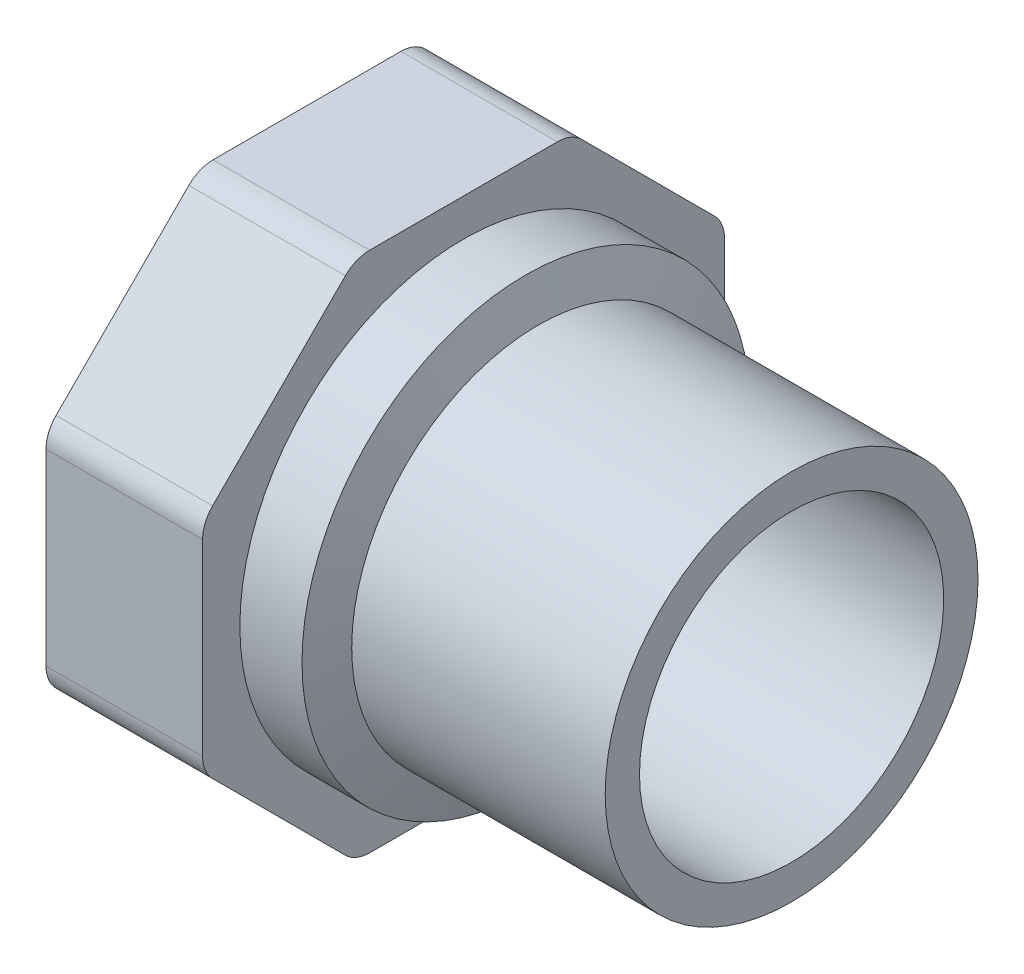
ISO-10303-21;
HEADER;
FILE_DESCRIPTION(('STEP AP214'),'2;1');
FILE_NAME('part.step','',(''),(''),'','','');
FILE_SCHEMA(('AUTOMOTIVE_DESIGN { 1 0 10303 214 1 1 1 1 }'));
ENDSEC;
DATA;
#1=APPLICATION_CONTEXT('core data for automotive mechanical design processes');
#2=APPLICATION_PROTOCOL_DEFINITION('international standard','automotive_design',2000,#1);
#3=PRODUCT_CONTEXT('',#1,'mechanical');
#4=PRODUCT('Part','Part','',(#3));
#5=PRODUCT_RELATED_PRODUCT_CATEGORY('part','',(#4));
#6=PRODUCT_DEFINITION_FORMATION('','',#4);
#7=PRODUCT_DEFINITION_CONTEXT('part definition',#1,'design');
#8=PRODUCT_DEFINITION('design','',#6,#7);
#9=PRODUCT_DEFINITION_SHAPE('','',#8);
#10=(LENGTH_UNIT() NAMED_UNIT(*) SI_UNIT(.MILLI.,.METRE.));
#11=(NAMED_UNIT(*) PLANE_ANGLE_UNIT() SI_UNIT($,.RADIAN.));
#12=(NAMED_UNIT(*) SI_UNIT($,.STERADIAN.) SOLID_ANGLE_UNIT());
#13=UNCERTAINTY_MEASURE_WITH_UNIT(LENGTH_MEASURE(1.E-05),#10,'distance_accuracy_value','');
#14=(GEOMETRIC_REPRESENTATION_CONTEXT(3) GLOBAL_UNCERTAINTY_ASSIGNED_CONTEXT((#13)) GLOBAL_UNIT_ASSIGNED_CONTEXT((#10,
#11,#12)) REPRESENTATION_CONTEXT('',''));
#15=CARTESIAN_POINT('',(0.,0.,0.));
#16=DIRECTION('',(0.,0.,1.));
#17=DIRECTION('',(1.,0.,0.));
#18=AXIS2_PLACEMENT_3D('',#15,#16,#17);
#19=CARTESIAN_POINT('',(-34.,0.,0.));
#20=DIRECTION('',(-1.,0.,0.));
#21=DIRECTION('',(0.,0.,1.));
#22=AXIS2_PLACEMENT_3D('',#19,#20,#21);
#23=CYLINDRICAL_SURFACE('',#22,25.);
#24=CARTESIAN_POINT('',(-34.,0.,0.));
#25=DIRECTION('',(1.,0.,0.));
#26=DIRECTION('',(0.,1.,0.));
#27=AXIS2_PLACEMENT_3D('',#24,#25,#26);
#28=CIRCLE('',#27,25.);
#29=CARTESIAN_POINT('',(-34.,25.,0.));
#30=VERTEX_POINT('',#29);
#31=EDGE_CURVE('E193',#30,#30,#28,.F.);
#32=ORIENTED_EDGE('',*,*,#31,.F.);
#33=EDGE_LOOP('',(#32));
#34=FACE_BOUND('',#33,.T.);
#35=CARTESIAN_POINT('',(0.,0.,0.));
#36=DIRECTION('',(-1.,0.,0.));
#37=DIRECTION('',(0.,0.,1.));
#38=AXIS2_PLACEMENT_3D('',#35,#36,#37);
#39=CIRCLE('',#38,25.);
#40=CARTESIAN_POINT('',(0.,0.,25.));
#41=VERTEX_POINT('',#40);
#42=EDGE_CURVE('E18',#41,#41,#39,.F.);
#43=ORIENTED_EDGE('',*,*,#42,.F.);
#44=EDGE_LOOP('',(#43));
#45=FACE_BOUND('',#44,.T.);
#46=ADVANCED_FACE('F15',(#34,#45),#23,.T.);
#47=CARTESIAN_POINT('',(-34.,0.,0.));
#48=DIRECTION('',(-1.,0.,0.));
#49=DIRECTION('',(0.,0.,1.));
#50=AXIS2_PLACEMENT_3D('',#47,#48,#49);
#51=CONICAL_SURFACE('',#50,25.,1.24904577239826);
#52=CARTESIAN_POINT('',(-35.6666666666666,0.,0.));
#53=DIRECTION('',(-1.,0.,0.));
#54=DIRECTION('',(0.,1.,0.));
#55=AXIS2_PLACEMENT_3D('',#52,#53,#54);
#56=CIRCLE('',#55,30.);
#57=CARTESIAN_POINT('',(-35.6666666666666,30.,0.));
#58=VERTEX_POINT('',#57);
#59=EDGE_CURVE('E189',#58,#58,#56,.T.);
#60=ORIENTED_EDGE('',*,*,#59,.F.);
#61=EDGE_LOOP('',(#60));
#62=FACE_BOUND('',#61,.T.);
#63=ORIENTED_EDGE('',*,*,#31,.T.);
#64=EDGE_LOOP('',(#63));
#65=FACE_BOUND('',#64,.T.);
#66=ADVANCED_FACE('F268',(#62,#65),#51,.T.);
#67=CARTESIAN_POINT('',(0.,25.,25.3000021083545));
#68=DIRECTION('',(1.,0.,0.));
#69=DIRECTION('',(0.,-1.,0.));
#70=AXIS2_PLACEMENT_3D('',#67,#68,#69);
#71=PLANE('',#70);
#72=CARTESIAN_POINT('',(0.,0.,0.));
#73=DIRECTION('',(-1.,0.,0.));
#74=DIRECTION('',(0.,0.,1.));
#75=AXIS2_PLACEMENT_3D('',#72,#73,#74);
#76=CIRCLE('',#75,20.4);
#77=CARTESIAN_POINT('',(0.,0.,20.4));
#78=VERTEX_POINT('',#77);
#79=EDGE_CURVE('E192',#78,#78,#76,.F.);
#80=ORIENTED_EDGE('',*,*,#79,.F.);
#81=EDGE_LOOP('',(#80));
#82=FACE_BOUND('',#81,.T.);
#83=ORIENTED_EDGE('',*,*,#42,.T.);
#84=EDGE_LOOP('',(#83));
#85=FACE_BOUND('',#84,.T.);
#86=ADVANCED_FACE('F264',(#82,#85),#71,.T.);
#87=CARTESIAN_POINT('',(-44.,0.,0.));
#88=DIRECTION('',(-1.,0.,0.));
#89=DIRECTION('',(0.,0.,1.));
#90=AXIS2_PLACEMENT_3D('',#87,#88,#89);
#91=CYLINDRICAL_SURFACE('',#90,30.);
#92=CARTESIAN_POINT('',(-44.,0.,0.));
#93=DIRECTION('',(-1.,0.,0.));
#94=DIRECTION('',(0.,0.,1.));
#95=AXIS2_PLACEMENT_3D('',#92,#93,#94);
#96=CIRCLE('',#95,30.);
#97=CARTESIAN_POINT('',(-44.,0.,30.));
#98=VERTEX_POINT('',#97);
#99=EDGE_CURVE('E188',#98,#98,#96,.T.);
#100=ORIENTED_EDGE('',*,*,#99,.F.);
#101=EDGE_LOOP('',(#100));
#102=FACE_BOUND('',#101,.T.);
#103=ORIENTED_EDGE('',*,*,#59,.T.);
#104=EDGE_LOOP('',(#103));
#105=FACE_BOUND('',#104,.T.);
#106=ADVANCED_FACE('F267',(#102,#105),#91,.T.);
#107=CARTESIAN_POINT('',(0.,0.,0.));
#108=DIRECTION('',(-1.,0.,0.));
#109=DIRECTION('',(0.,0.,1.));
#110=AXIS2_PLACEMENT_3D('',#107,#108,#109);
#111=CYLINDRICAL_SURFACE('',#110,20.4);
#112=ORIENTED_EDGE('',*,*,#79,.T.);
#113=EDGE_LOOP('',(#112));
#114=FACE_BOUND('',#113,.T.);
#115=CARTESIAN_POINT('',(-43.4969631777738,0.,0.));
#116=DIRECTION('',(1.,0.,0.));
#117=DIRECTION('',(0.,1.,0.));
#118=AXIS2_PLACEMENT_3D('',#115,#116,#117);
#119=CIRCLE('',#118,20.4);
#120=CARTESIAN_POINT('',(-43.4969631777738,20.4,0.));
#121=VERTEX_POINT('',#120);
#122=EDGE_CURVE('E135',#121,#121,#119,.T.);
#123=ORIENTED_EDGE('',*,*,#122,.F.);
#124=EDGE_LOOP('',(#123));
#125=FACE_BOUND('',#124,.T.);
#126=ADVANCED_FACE('F261',(#114,#125),#111,.F.);
#127=CARTESIAN_POINT('',(-44.,35.,35.));
#128=DIRECTION('',(1.,0.,0.));
#129=DIRECTION('',(0.,-1.,0.));
#130=AXIS2_PLACEMENT_3D('',#127,#128,#129);
#131=PLANE('',#130);
#132=ORIENTED_EDGE('',*,*,#99,.T.);
#133=EDGE_LOOP('',(#132));
#134=FACE_BOUND('',#133,.T.);
#135=CARTESIAN_POINT('',(-44.,12.5920922961421,30.4));
#136=DIRECTION('',(1.,0.,0.));
#137=DIRECTION('',(0.,0.,-1.));
#138=AXIS2_PLACEMENT_3D('',#135,#136,#137);
#139=CIRCLE('',#138,4.6);
#140=CARTESIAN_POINT('',(-44.,12.5920922961421,35.));
#141=VERTEX_POINT('',#140);
#142=CARTESIAN_POINT('',(-44.,15.8447834896002,33.6526911934581));
#143=VERTEX_POINT('',#142);
#144=EDGE_CURVE('E254',#141,#143,#139,.F.);
#145=ORIENTED_EDGE('',*,*,#144,.F.);
#146=DIRECTION('',(0.,1.,0.));
#147=VECTOR('',#146,1.);
#148=CARTESIAN_POINT('',(-44.,0.,35.));
#149=LINE('',#148,#147);
#150=CARTESIAN_POINT('',(-44.,-12.5920922961421,35.));
#151=VERTEX_POINT('',#150);
#152=EDGE_CURVE('E132',#151,#141,#149,.T.);
#153=ORIENTED_EDGE('',*,*,#152,.F.);
#154=CARTESIAN_POINT('',(-44.,-12.5920922961421,30.4));
#155=DIRECTION('',(1.,0.,0.));
#156=DIRECTION('',(0.,0.,-1.));
#157=AXIS2_PLACEMENT_3D('',#154,#155,#156);
#158=CIRCLE('',#157,4.59999999999999);
#159=CARTESIAN_POINT('',(-44.,-15.8447834896002,33.6526911934581));
#160=VERTEX_POINT('',#159);
#161=EDGE_CURVE('E126',#160,#151,#158,.F.);
#162=ORIENTED_EDGE('',*,*,#161,.F.);
#163=DIRECTION('',(0.,0.707106781186547,0.707106781186548));
#164=VECTOR('',#163,1.);
#165=CARTESIAN_POINT('',(-44.,-24.7487373415292,24.7487373415291));
#166=LINE('',#165,#164);
#167=CARTESIAN_POINT('',(-44.,-33.6526911934581,15.8447834896002));
#168=VERTEX_POINT('',#167);
#169=EDGE_CURVE('E130',#168,#160,#166,.T.);
#170=ORIENTED_EDGE('',*,*,#169,.F.);
#171=CARTESIAN_POINT('',(-44.,-30.3999999999999,12.5920922961421));
#172=DIRECTION('',(1.,0.,0.));
#173=DIRECTION('',(0.,0.,-1.));
#174=AXIS2_PLACEMENT_3D('',#171,#172,#173);
#175=CIRCLE('',#174,4.60000000000004);
#176=CARTESIAN_POINT('',(-44.,-35.,12.5920922961421));
#177=VERTEX_POINT('',#176);
#178=EDGE_CURVE('E149',#177,#168,#175,.F.);
#179=ORIENTED_EDGE('',*,*,#178,.F.);
#180=DIRECTION('',(0.,0.,1.));
#181=VECTOR('',#180,1.);
#182=CARTESIAN_POINT('',(-44.,-35.,0.));
#183=LINE('',#182,#181);
#184=CARTESIAN_POINT('',(-44.,-35.,-12.5920922961421));
#185=VERTEX_POINT('',#184);
#186=EDGE_CURVE('E154',#185,#177,#183,.T.);
#187=ORIENTED_EDGE('',*,*,#186,.F.);
#188=CARTESIAN_POINT('',(-44.,-30.4,-12.5920922961421));
#189=DIRECTION('',(1.,0.,0.));
#190=DIRECTION('',(0.,0.,-1.));
#191=AXIS2_PLACEMENT_3D('',#188,#189,#190);
#192=CIRCLE('',#191,4.60000000000004);
#193=CARTESIAN_POINT('',(-44.,-33.6526911934581,-15.8447834896002));
#194=VERTEX_POINT('',#193);
#195=EDGE_CURVE('E239',#194,#185,#192,.F.);
#196=ORIENTED_EDGE('',*,*,#195,.F.);
#197=DIRECTION('',(0.,-0.707106781186548,0.707106781186547));
#198=VECTOR('',#197,1.);
#199=CARTESIAN_POINT('',(-44.,-24.7487373415292,-24.7487373415292));
#200=LINE('',#199,#198);
#201=CARTESIAN_POINT('',(-44.,-15.8447834896002,-33.6526911934581));
#202=VERTEX_POINT('',#201);
#203=EDGE_CURVE('E159',#202,#194,#200,.T.);
#204=ORIENTED_EDGE('',*,*,#203,.F.);
#205=CARTESIAN_POINT('',(-44.,-12.5920922961421,-30.4));
#206=DIRECTION('',(1.,0.,0.));
#207=DIRECTION('',(0.,0.,-1.));
#208=AXIS2_PLACEMENT_3D('',#205,#206,#207);
#209=CIRCLE('',#208,4.59999999999998);
#210=CARTESIAN_POINT('',(-44.,-12.5920922961421,-35.));
#211=VERTEX_POINT('',#210);
#212=EDGE_CURVE('E242',#211,#202,#209,.F.);
#213=ORIENTED_EDGE('',*,*,#212,.F.);
#214=DIRECTION('',(0.,-1.,0.));
#215=VECTOR('',#214,1.);
#216=CARTESIAN_POINT('',(-44.,0.,-35.));
#217=LINE('',#216,#215);
#218=CARTESIAN_POINT('',(-44.,12.5920922961421,-35.));
#219=VERTEX_POINT('',#218);
#220=EDGE_CURVE('E164',#219,#211,#217,.T.);
#221=ORIENTED_EDGE('',*,*,#220,.F.);
#222=CARTESIAN_POINT('',(-44.,12.5920922961421,-30.4));
#223=DIRECTION('',(1.,0.,0.));
#224=DIRECTION('',(0.,0.,-1.));
#225=AXIS2_PLACEMENT_3D('',#222,#223,#224);
#226=CIRCLE('',#225,4.59999999999999);
#227=CARTESIAN_POINT('',(-44.,15.8447834896002,-33.6526911934581));
#228=VERTEX_POINT('',#227);
#229=EDGE_CURVE('E245',#228,#219,#226,.F.);
#230=ORIENTED_EDGE('',*,*,#229,.F.);
#231=DIRECTION('',(0.,-0.707106781186548,-0.707106781186548));
#232=VECTOR('',#231,1.);
#233=CARTESIAN_POINT('',(-44.,24.7487373415292,-24.7487373415292));
#234=LINE('',#233,#232);
#235=CARTESIAN_POINT('',(-44.,33.6526911934581,-15.8447834896002));
#236=VERTEX_POINT('',#235);
#237=EDGE_CURVE('E169',#236,#228,#234,.T.);
#238=ORIENTED_EDGE('',*,*,#237,.F.);
#239=CARTESIAN_POINT('',(-44.,30.4,-12.5920922961421));
#240=DIRECTION('',(1.,0.,0.));
#241=DIRECTION('',(0.,0.,-1.));
#242=AXIS2_PLACEMENT_3D('',#239,#240,#241);
#243=CIRCLE('',#242,4.60000000000003);
#244=CARTESIAN_POINT('',(-44.,35.,-12.5920922961421));
#245=VERTEX_POINT('',#244);
#246=EDGE_CURVE('E248',#245,#236,#243,.F.);
#247=ORIENTED_EDGE('',*,*,#246,.F.);
#248=DIRECTION('',(0.,0.,-1.));
#249=VECTOR('',#248,1.);
#250=CARTESIAN_POINT('',(-44.,35.,0.));
#251=LINE('',#250,#249);
#252=CARTESIAN_POINT('',(-44.,35.,12.5920922961421));
#253=VERTEX_POINT('',#252);
#254=EDGE_CURVE('E174',#253,#245,#251,.T.);
#255=ORIENTED_EDGE('',*,*,#254,.F.);
#256=CARTESIAN_POINT('',(-44.,30.4,12.5920922961421));
#257=DIRECTION('',(1.,0.,0.));
#258=DIRECTION('',(0.,0.,-1.));
#259=AXIS2_PLACEMENT_3D('',#256,#257,#258);
#260=CIRCLE('',#259,4.60000000000003);
#261=CARTESIAN_POINT('',(-44.,33.6526911934581,15.8447834896002));
#262=VERTEX_POINT('',#261);
#263=EDGE_CURVE('E251',#262,#253,#260,.F.);
#264=ORIENTED_EDGE('',*,*,#263,.F.);
#265=DIRECTION('',(0.,0.707106781186547,-0.707106781186547));
#266=VECTOR('',#265,1.);
#267=CARTESIAN_POINT('',(-44.,24.7487373415292,24.7487373415292));
#268=LINE('',#267,#266);
#269=EDGE_CURVE('E179',#143,#262,#268,.T.);
#270=ORIENTED_EDGE('',*,*,#269,.F.);
#271=EDGE_LOOP('',(#145,#153,#162,#170,#179,#187,#196,#204,#213,#221,#230,#238,#247,#255,#264,#270));
#272=FACE_BOUND('',#271,.T.);
#273=ADVANCED_FACE('F128',(#134,#272),#131,.T.);
#274=CARTESIAN_POINT('',(-44.,0.,0.));
#275=DIRECTION('',(-1.,0.,0.));
#276=DIRECTION('',(0.,0.,1.));
#277=AXIS2_PLACEMENT_3D('',#274,#275,#276);
#278=CONICAL_SURFACE('',#277,21.2712853341737,1.0471975511966);
#279=ORIENTED_EDGE('',*,*,#122,.T.);
#280=EDGE_LOOP('',(#279));
#281=FACE_BOUND('',#280,.T.);
#282=CARTESIAN_POINT('',(-44.,0.,0.));
#283=DIRECTION('',(1.,0.,0.));
#284=DIRECTION('',(0.,1.,0.));
#285=AXIS2_PLACEMENT_3D('',#282,#283,#284);
#286=CIRCLE('',#285,21.2712853341737);
#287=CARTESIAN_POINT('',(-44.,21.2712853341737,0.));
#288=VERTEX_POINT('',#287);
#289=EDGE_CURVE('E153',#288,#288,#286,.T.);
#290=ORIENTED_EDGE('',*,*,#289,.F.);
#291=EDGE_LOOP('',(#290));
#292=FACE_BOUND('',#291,.T.);
#293=ADVANCED_FACE('F438',(#281,#292),#278,.F.);
#294=CARTESIAN_POINT('',(-44.,-12.5920922961421,30.4));
#295=DIRECTION('',(1.,0.,0.));
#296=DIRECTION('',(0.,0.,-1.));
#297=AXIS2_PLACEMENT_3D('',#294,#295,#296);
#298=CYLINDRICAL_SURFACE('',#297,4.59999999999999);
#299=CARTESIAN_POINT('',(-65.,-12.5920922961421,30.4));
#300=DIRECTION('',(1.,0.,0.));
#301=DIRECTION('',(0.,0.,-1.));
#302=AXIS2_PLACEMENT_3D('',#299,#300,#301);
#303=CIRCLE('',#302,4.59999999999999);
#304=CARTESIAN_POINT('',(-65.,-15.8447834896002,33.6526911934581));
#305=VERTEX_POINT('',#304);
#306=CARTESIAN_POINT('',(-65.,-12.5920922961421,35.));
#307=VERTEX_POINT('',#306);
#308=EDGE_CURVE('E141',#305,#307,#303,.F.);
#309=ORIENTED_EDGE('',*,*,#308,.F.);
#310=DIRECTION('',(1.,0.,0.));
#311=VECTOR('',#310,1.);
#312=CARTESIAN_POINT('',(-65.,-15.8447834896002,33.6526911934581));
#313=LINE('',#312,#311);
#314=EDGE_CURVE('E138',#160,#305,#313,.F.);
#315=ORIENTED_EDGE('',*,*,#314,.F.);
#316=ORIENTED_EDGE('',*,*,#161,.T.);
#317=DIRECTION('',(1.,0.,0.));
#318=VECTOR('',#317,1.);
#319=CARTESIAN_POINT('',(-65.,-12.5920922961421,35.));
#320=LINE('',#319,#318);
#321=EDGE_CURVE('E185',#307,#151,#320,.T.);
#322=ORIENTED_EDGE('',*,*,#321,.F.);
#323=EDGE_LOOP('',(#309,#315,#316,#322));
#324=FACE_BOUND('',#323,.T.);
#325=ADVANCED_FACE('F139',(#324),#298,.T.);
#326=CARTESIAN_POINT('',(-65.,12.5920922961421,35.));
#327=DIRECTION('',(0.,0.,1.));
#328=DIRECTION('',(0.,-1.,0.));
#329=AXIS2_PLACEMENT_3D('',#326,#327,#328);
#330=PLANE('',#329);
#331=DIRECTION('',(0.,1.,0.));
#332=VECTOR('',#331,1.);
#333=CARTESIAN_POINT('',(-65.,0.,35.));
#334=LINE('',#333,#332);
#335=CARTESIAN_POINT('',(-65.,12.5920922961421,35.));
#336=VERTEX_POINT('',#335);
#337=EDGE_CURVE('E236',#307,#336,#334,.T.);
#338=ORIENTED_EDGE('',*,*,#337,.F.);
#339=ORIENTED_EDGE('',*,*,#321,.T.);
#340=ORIENTED_EDGE('',*,*,#152,.T.);
#341=DIRECTION('',(1.,0.,0.));
#342=VECTOR('',#341,1.);
#343=CARTESIAN_POINT('',(-54.5,12.5920922961421,35.));
#344=LINE('',#343,#342);
#345=EDGE_CURVE('E183',#336,#141,#344,.T.);
#346=ORIENTED_EDGE('',*,*,#345,.F.);
#347=EDGE_LOOP('',(#338,#339,#340,#346));
#348=FACE_BOUND('',#347,.T.);
#349=ADVANCED_FACE('F387',(#348),#330,.T.);
#350=CARTESIAN_POINT('',(-44.,12.5920922961421,30.4));
#351=DIRECTION('',(1.,0.,0.));
#352=DIRECTION('',(0.,0.,-1.));
#353=AXIS2_PLACEMENT_3D('',#350,#351,#352);
#354=CYLINDRICAL_SURFACE('',#353,4.6);
#355=CARTESIAN_POINT('',(-65.,12.5920922961421,30.4));
#356=DIRECTION('',(1.,0.,0.));
#357=DIRECTION('',(0.,0.,-1.));
#358=AXIS2_PLACEMENT_3D('',#355,#356,#357);
#359=CIRCLE('',#358,4.6);
#360=CARTESIAN_POINT('',(-65.,15.8447834896002,33.6526911934581));
#361=VERTEX_POINT('',#360);
#362=EDGE_CURVE('E233',#336,#361,#359,.F.);
#363=ORIENTED_EDGE('',*,*,#362,.F.);
#364=ORIENTED_EDGE('',*,*,#345,.T.);
#365=ORIENTED_EDGE('',*,*,#144,.T.);
#366=DIRECTION('',(1.,0.,0.));
#367=VECTOR('',#366,1.);
#368=CARTESIAN_POINT('',(-65.,15.8447834896002,33.6526911934581));
#369=LINE('',#368,#367);
#370=EDGE_CURVE('E182',#361,#143,#369,.T.);
#371=ORIENTED_EDGE('',*,*,#370,.F.);
#372=EDGE_LOOP('',(#363,#364,#365,#371));
#373=FACE_BOUND('',#372,.T.);
#374=ADVANCED_FACE('F425',(#373),#354,.T.);
#375=CARTESIAN_POINT('',(-65.,33.6526911934581,15.8447834896002));
#376=DIRECTION('',(0.,0.707106781186547,0.707106781186547));
#377=DIRECTION('',(0.,-0.707106781186547,0.707106781186547));
#378=AXIS2_PLACEMENT_3D('',#375,#376,#377);
#379=PLANE('',#378);
#380=CARTESIAN_POINT('',(-65.,15.8447834896002,33.6526911934581));
#381=CARTESIAN_POINT('',(-65.,16.5867796439276,32.9106950391307));
#382=CARTESIAN_POINT('',(-65.,17.328775798255,32.1686988848033));
#383=CARTESIAN_POINT('',(-65.,18.8127681069099,30.6847065761485));
#384=CARTESIAN_POINT('',(-65.,19.5547642612373,29.9427104218211));
#385=CARTESIAN_POINT('',(-65.,21.0387565698921,28.4587181131662));
#386=CARTESIAN_POINT('',(-65.,21.7807527242195,27.7167219588388));
#387=CARTESIAN_POINT('',(-65.,23.2647450328743,26.232729650184));
#388=CARTESIAN_POINT('',(-65.,24.0067411872017,25.4907334958566));
#389=CARTESIAN_POINT('',(-65.,25.4907334958566,24.0067411872018));
#390=CARTESIAN_POINT('',(-65.,26.232729650184,23.2647450328743));
#391=CARTESIAN_POINT('',(-65.,27.7167219588388,21.7807527242195));
#392=CARTESIAN_POINT('',(-65.,28.4587181131662,21.0387565698921));
#393=CARTESIAN_POINT('',(-65.,29.942710421821,19.5547642612373));
#394=CARTESIAN_POINT('',(-65.,30.6847065761485,18.8127681069099));
#395=CARTESIAN_POINT('',(-65.,32.1686988848033,17.328775798255));
#396=CARTESIAN_POINT('',(-65.,32.9106950391307,16.5867796439276));
#397=CARTESIAN_POINT('',(-65.,33.6526911934581,15.8447834896002));
#398=B_SPLINE_CURVE_WITH_KNOTS('',3,(#380,#381,#382,#383,#384,#385,#386,#387,#388,#389,#390,
#391,#392,#393,#394,#395,#396,#397),.UNSPECIFIED.,.F.,.F.,(4,2,2,2,2,2,2,2,4),(0.,
3.14802307403552,6.29604614807105,9.44406922210656,12.5920922961421,15.7401153701776,
18.8881384442131,22.0361615182486,25.1841845922842),.UNSPECIFIED.);
#399=CARTESIAN_POINT('',(-65.,33.6526911934581,15.8447834896002));
#400=VERTEX_POINT('',#399);
#401=EDGE_CURVE('E232',#361,#400,#398,.T.);
#402=ORIENTED_EDGE('',*,*,#401,.F.);
#403=ORIENTED_EDGE('',*,*,#370,.T.);
#404=ORIENTED_EDGE('',*,*,#269,.T.);
#405=DIRECTION('',(1.,0.,0.));
#406=VECTOR('',#405,1.);
#407=CARTESIAN_POINT('',(-54.5,33.6526911934581,15.8447834896002));
#408=LINE('',#407,#406);
#409=EDGE_CURVE('E178',#400,#262,#408,.T.);
#410=ORIENTED_EDGE('',*,*,#409,.F.);
#411=EDGE_LOOP('',(#402,#403,#404,#410));
#412=FACE_BOUND('',#411,.T.);
#413=ADVANCED_FACE('F423',(#412),#379,.T.);
#414=CARTESIAN_POINT('',(-44.,30.4,12.5920922961421));
#415=DIRECTION('',(1.,0.,0.));
#416=DIRECTION('',(0.,0.,-1.));
#417=AXIS2_PLACEMENT_3D('',#414,#415,#416);
#418=CYLINDRICAL_SURFACE('',#417,4.60000000000003);
#419=CARTESIAN_POINT('',(-65.,30.4,12.5920922961421));
#420=DIRECTION('',(1.,0.,0.));
#421=DIRECTION('',(0.,0.,-1.));
#422=AXIS2_PLACEMENT_3D('',#419,#420,#421);
#423=CIRCLE('',#422,4.60000000000003);
#424=CARTESIAN_POINT('',(-65.,35.,12.5920922961421));
#425=VERTEX_POINT('',#424);
#426=EDGE_CURVE('E229',#400,#425,#423,.F.);
#427=ORIENTED_EDGE('',*,*,#426,.F.);
#428=ORIENTED_EDGE('',*,*,#409,.T.);
#429=ORIENTED_EDGE('',*,*,#263,.T.);
#430=DIRECTION('',(1.,0.,0.));
#431=VECTOR('',#430,1.);
#432=CARTESIAN_POINT('',(-65.,35.,12.5920922961421));
#433=LINE('',#432,#431);
#434=EDGE_CURVE('E177',#425,#253,#433,.T.);
#435=ORIENTED_EDGE('',*,*,#434,.F.);
#436=EDGE_LOOP('',(#427,#428,#429,#435));
#437=FACE_BOUND('',#436,.T.);
#438=ADVANCED_FACE('F420',(#437),#418,.T.);
#439=CARTESIAN_POINT('',(-65.,35.,-12.5920922961421));
#440=DIRECTION('',(0.,1.,0.));
#441=DIRECTION('',(0.,0.,1.));
#442=AXIS2_PLACEMENT_3D('',#439,#440,#441);
#443=PLANE('',#442);
#444=DIRECTION('',(0.,0.,-1.));
#445=VECTOR('',#444,1.);
#446=CARTESIAN_POINT('',(-65.,35.,35.));
#447=LINE('',#446,#445);
#448=CARTESIAN_POINT('',(-65.,35.,-12.5920922961421));
#449=VERTEX_POINT('',#448);
#450=EDGE_CURVE('E228',#425,#449,#447,.T.);
#451=ORIENTED_EDGE('',*,*,#450,.F.);
#452=ORIENTED_EDGE('',*,*,#434,.T.);
#453=ORIENTED_EDGE('',*,*,#254,.T.);
#454=DIRECTION('',(1.,0.,0.));
#455=VECTOR('',#454,1.);
#456=CARTESIAN_POINT('',(-54.5,35.,-12.5920922961421));
#457=LINE('',#456,#455);
#458=EDGE_CURVE('E173',#449,#245,#457,.T.);
#459=ORIENTED_EDGE('',*,*,#458,.F.);
#460=EDGE_LOOP('',(#451,#452,#453,#459));
#461=FACE_BOUND('',#460,.T.);
#462=ADVANCED_FACE('F417',(#461),#443,.T.);
#463=CARTESIAN_POINT('',(-44.,30.4,-12.5920922961421));
#464=DIRECTION('',(1.,0.,0.));
#465=DIRECTION('',(0.,0.,-1.));
#466=AXIS2_PLACEMENT_3D('',#463,#464,#465);
#467=CYLINDRICAL_SURFACE('',#466,4.60000000000003);
#468=CARTESIAN_POINT('',(-65.,30.4,-12.5920922961421));
#469=DIRECTION('',(1.,0.,0.));
#470=DIRECTION('',(0.,0.,-1.));
#471=AXIS2_PLACEMENT_3D('',#468,#469,#470);
#472=CIRCLE('',#471,4.60000000000003);
#473=CARTESIAN_POINT('',(-65.,33.6526911934581,-15.8447834896002));
#474=VERTEX_POINT('',#473);
#475=EDGE_CURVE('E225',#449,#474,#472,.F.);
#476=ORIENTED_EDGE('',*,*,#475,.F.);
#477=ORIENTED_EDGE('',*,*,#458,.T.);
#478=ORIENTED_EDGE('',*,*,#246,.T.);
#479=DIRECTION('',(1.,0.,0.));
#480=VECTOR('',#479,1.);
#481=CARTESIAN_POINT('',(-65.,33.6526911934581,-15.8447834896002));
#482=LINE('',#481,#480);
#483=EDGE_CURVE('E172',#474,#236,#482,.T.);
#484=ORIENTED_EDGE('',*,*,#483,.F.);
#485=EDGE_LOOP('',(#476,#477,#478,#484));
#486=FACE_BOUND('',#485,.T.);
#487=ADVANCED_FACE('F414',(#486),#467,.T.);
#488=CARTESIAN_POINT('',(-65.,15.8447834896002,-33.6526911934581));
#489=DIRECTION('',(0.,0.707106781186547,-0.707106781186547));
#490=DIRECTION('',(0.,0.707106781186547,0.707106781186547));
#491=AXIS2_PLACEMENT_3D('',#488,#489,#490);
#492=PLANE('',#491);
#493=CARTESIAN_POINT('',(-65.,33.6526911934581,-15.8447834896002));
#494=CARTESIAN_POINT('',(-65.,32.9106950391307,-16.5867796439276));
#495=CARTESIAN_POINT('',(-65.,32.1686988848033,-17.328775798255));
#496=CARTESIAN_POINT('',(-65.,30.6847065761485,-18.8127681069099));
#497=CARTESIAN_POINT('',(-65.,29.9427104218211,-19.5547642612373));
#498=CARTESIAN_POINT('',(-65.,28.4587181131662,-21.0387565698921));
#499=CARTESIAN_POINT('',(-65.,27.7167219588388,-21.7807527242195));
#500=CARTESIAN_POINT('',(-65.,26.232729650184,-23.2647450328743));
#501=CARTESIAN_POINT('',(-65.,25.4907334958566,-24.0067411872017));
#502=CARTESIAN_POINT('',(-65.,24.0067411872018,-25.4907334958566));
#503=CARTESIAN_POINT('',(-65.,23.2647450328744,-26.232729650184));
#504=CARTESIAN_POINT('',(-65.,21.7807527242195,-27.7167219588388));
#505=CARTESIAN_POINT('',(-65.,21.0387565698921,-28.4587181131662));
#506=CARTESIAN_POINT('',(-65.,19.5547642612373,-29.942710421821));
#507=CARTESIAN_POINT('',(-65.,18.8127681069099,-30.6847065761485));
#508=CARTESIAN_POINT('',(-65.,17.3287757982551,-32.1686988848033));
#509=CARTESIAN_POINT('',(-65.,16.5867796439276,-32.9106950391307));
#510=CARTESIAN_POINT('',(-65.,15.8447834896002,-33.6526911934581));
#511=B_SPLINE_CURVE_WITH_KNOTS('',3,(#493,#494,#495,#496,#497,#498,#499,#500,#501,#502,#503,
#504,#505,#506,#507,#508,#509,#510),.UNSPECIFIED.,.F.,.F.,(4,2,2,2,2,2,2,2,4),(0.,
3.14802307403552,6.29604614807105,9.44406922210656,12.5920922961421,15.7401153701776,
18.8881384442131,22.0361615182486,25.1841845922842),.UNSPECIFIED.);
#512=CARTESIAN_POINT('',(-65.,15.8447834896002,-33.6526911934581));
#513=VERTEX_POINT('',#512);
#514=EDGE_CURVE('E224',#474,#513,#511,.T.);
#515=ORIENTED_EDGE('',*,*,#514,.F.);
#516=ORIENTED_EDGE('',*,*,#483,.T.);
#517=ORIENTED_EDGE('',*,*,#237,.T.);
#518=DIRECTION('',(1.,0.,0.));
#519=VECTOR('',#518,1.);
#520=CARTESIAN_POINT('',(-54.5,15.8447834896002,-33.6526911934581));
#521=LINE('',#520,#519);
#522=EDGE_CURVE('E168',#513,#228,#521,.T.);
#523=ORIENTED_EDGE('',*,*,#522,.F.);
#524=EDGE_LOOP('',(#515,#516,#517,#523));
#525=FACE_BOUND('',#524,.T.);
#526=ADVANCED_FACE('F411',(#525),#492,.T.);
#527=CARTESIAN_POINT('',(-44.,12.5920922961421,-30.4));
#528=DIRECTION('',(1.,0.,0.));
#529=DIRECTION('',(0.,0.,-1.));
#530=AXIS2_PLACEMENT_3D('',#527,#528,#529);
#531=CYLINDRICAL_SURFACE('',#530,4.59999999999999);
#532=CARTESIAN_POINT('',(-65.,12.5920922961421,-30.4));
#533=DIRECTION('',(1.,0.,0.));
#534=DIRECTION('',(0.,0.,-1.));
#535=AXIS2_PLACEMENT_3D('',#532,#533,#534);
#536=CIRCLE('',#535,4.59999999999999);
#537=CARTESIAN_POINT('',(-65.,12.5920922961421,-35.));
#538=VERTEX_POINT('',#537);
#539=EDGE_CURVE('E221',#513,#538,#536,.F.);
#540=ORIENTED_EDGE('',*,*,#539,.F.);
#541=ORIENTED_EDGE('',*,*,#522,.T.);
#542=ORIENTED_EDGE('',*,*,#229,.T.);
#543=DIRECTION('',(1.,0.,0.));
#544=VECTOR('',#543,1.);
#545=CARTESIAN_POINT('',(-65.,12.5920922961421,-35.));
#546=LINE('',#545,#544);
#547=EDGE_CURVE('E167',#538,#219,#546,.T.);
#548=ORIENTED_EDGE('',*,*,#547,.F.);
#549=EDGE_LOOP('',(#540,#541,#542,#548));
#550=FACE_BOUND('',#549,.T.);
#551=ADVANCED_FACE('F408',(#550),#531,.T.);
#552=CARTESIAN_POINT('',(-65.,-12.5920922961421,-35.));
#553=DIRECTION('',(0.,0.,-1.));
#554=DIRECTION('',(0.,1.,0.));
#555=AXIS2_PLACEMENT_3D('',#552,#553,#554);
#556=PLANE('',#555);
#557=DIRECTION('',(0.,-1.,0.));
#558=VECTOR('',#557,1.);
#559=CARTESIAN_POINT('',(-65.,0.,-35.));
#560=LINE('',#559,#558);
#561=CARTESIAN_POINT('',(-65.,-12.5920922961421,-35.));
#562=VERTEX_POINT('',#561);
#563=EDGE_CURVE('E220',#538,#562,#560,.T.);
#564=ORIENTED_EDGE('',*,*,#563,.F.);
#565=ORIENTED_EDGE('',*,*,#547,.T.);
#566=ORIENTED_EDGE('',*,*,#220,.T.);
#567=DIRECTION('',(1.,0.,0.));
#568=VECTOR('',#567,1.);
#569=CARTESIAN_POINT('',(-54.5,-12.5920922961421,-35.));
#570=LINE('',#569,#568);
#571=EDGE_CURVE('E163',#562,#211,#570,.T.);
#572=ORIENTED_EDGE('',*,*,#571,.F.);
#573=EDGE_LOOP('',(#564,#565,#566,#572));
#574=FACE_BOUND('',#573,.T.);
#575=ADVANCED_FACE('F405',(#574),#556,.T.);
#576=CARTESIAN_POINT('',(-44.,-12.5920922961421,-30.4));
#577=DIRECTION('',(1.,0.,0.));
#578=DIRECTION('',(0.,0.,-1.));
#579=AXIS2_PLACEMENT_3D('',#576,#577,#578);
#580=CYLINDRICAL_SURFACE('',#579,4.59999999999998);
#581=CARTESIAN_POINT('',(-65.,-12.5920922961421,-30.4));
#582=DIRECTION('',(1.,0.,0.));
#583=DIRECTION('',(0.,0.,-1.));
#584=AXIS2_PLACEMENT_3D('',#581,#582,#583);
#585=CIRCLE('',#584,4.59999999999998);
#586=CARTESIAN_POINT('',(-65.,-15.8447834896002,-33.6526911934581));
#587=VERTEX_POINT('',#586);
#588=EDGE_CURVE('E217',#562,#587,#585,.F.);
#589=ORIENTED_EDGE('',*,*,#588,.F.);
#590=ORIENTED_EDGE('',*,*,#571,.T.);
#591=ORIENTED_EDGE('',*,*,#212,.T.);
#592=DIRECTION('',(1.,0.,0.));
#593=VECTOR('',#592,1.);
#594=CARTESIAN_POINT('',(-65.,-15.8447834896002,-33.6526911934581));
#595=LINE('',#594,#593);
#596=EDGE_CURVE('E162',#587,#202,#595,.T.);
#597=ORIENTED_EDGE('',*,*,#596,.F.);
#598=EDGE_LOOP('',(#589,#590,#591,#597));
#599=FACE_BOUND('',#598,.T.);
#600=ADVANCED_FACE('F402',(#599),#580,.T.);
#601=CARTESIAN_POINT('',(-65.,-33.6526911934581,-15.8447834896002));
#602=DIRECTION('',(0.,-0.707106781186547,-0.707106781186548));
#603=DIRECTION('',(0.,0.707106781186548,-0.707106781186547));
#604=AXIS2_PLACEMENT_3D('',#601,#602,#603);
#605=PLANE('',#604);
#606=CARTESIAN_POINT('',(-65.,-15.8447834896002,-33.6526911934581));
#607=CARTESIAN_POINT('',(-65.,-16.5867796439276,-32.9106950391307));
#608=CARTESIAN_POINT('',(-65.,-17.328775798255,-32.1686988848033));
#609=CARTESIAN_POINT('',(-65.,-18.8127681069098,-30.6847065761485));
#610=CARTESIAN_POINT('',(-65.,-19.5547642612373,-29.942710421821));
#611=CARTESIAN_POINT('',(-65.,-21.0387565698921,-28.4587181131662));
#612=CARTESIAN_POINT('',(-65.,-21.7807527242195,-27.7167219588388));
#613=CARTESIAN_POINT('',(-65.,-23.2647450328743,-26.232729650184));
#614=CARTESIAN_POINT('',(-65.,-24.0067411872017,-25.4907334958566));
#615=CARTESIAN_POINT('',(-65.,-25.4907334958566,-24.0067411872018));
#616=CARTESIAN_POINT('',(-65.,-26.232729650184,-23.2647450328743));
#617=CARTESIAN_POINT('',(-65.,-27.7167219588388,-21.7807527242195));
#618=CARTESIAN_POINT('',(-65.,-28.4587181131662,-21.0387565698921));
#619=CARTESIAN_POINT('',(-65.,-29.942710421821,-19.5547642612373));
#620=CARTESIAN_POINT('',(-65.,-30.6847065761484,-18.8127681069099));
#621=CARTESIAN_POINT('',(-65.,-32.1686988848033,-17.3287757982551));
#622=CARTESIAN_POINT('',(-65.,-32.9106950391307,-16.5867796439276));
#623=CARTESIAN_POINT('',(-65.,-33.6526911934581,-15.8447834896002));
#624=B_SPLINE_CURVE_WITH_KNOTS('',3,(#606,#607,#608,#609,#610,#611,#612,#613,#614,#615,#616,
#617,#618,#619,#620,#621,#622,#623),.UNSPECIFIED.,.F.,.F.,(4,2,2,2,2,2,2,2,4),(0.,
3.14802307403552,6.29604614807104,9.44406922210656,12.5920922961421,15.7401153701776,
18.8881384442131,22.0361615182486,25.1841845922842),.UNSPECIFIED.);
#625=CARTESIAN_POINT('',(-65.,-33.6526911934581,-15.8447834896002));
#626=VERTEX_POINT('',#625);
#627=EDGE_CURVE('E216',#587,#626,#624,.T.);
#628=ORIENTED_EDGE('',*,*,#627,.F.);
#629=ORIENTED_EDGE('',*,*,#596,.T.);
#630=ORIENTED_EDGE('',*,*,#203,.T.);
#631=DIRECTION('',(1.,0.,0.));
#632=VECTOR('',#631,1.);
#633=CARTESIAN_POINT('',(-54.5,-33.6526911934581,-15.8447834896002));
#634=LINE('',#633,#632);
#635=EDGE_CURVE('E158',#626,#194,#634,.T.);
#636=ORIENTED_EDGE('',*,*,#635,.F.);
#637=EDGE_LOOP('',(#628,#629,#630,#636));
#638=FACE_BOUND('',#637,.T.);
#639=ADVANCED_FACE('F399',(#638),#605,.T.);
#640=CARTESIAN_POINT('',(-44.,-30.4,-12.5920922961421));
#641=DIRECTION('',(1.,0.,0.));
#642=DIRECTION('',(0.,0.,-1.));
#643=AXIS2_PLACEMENT_3D('',#640,#641,#642);
#644=CYLINDRICAL_SURFACE('',#643,4.60000000000004);
#645=CARTESIAN_POINT('',(-65.,-30.4,-12.5920922961421));
#646=DIRECTION('',(1.,0.,0.));
#647=DIRECTION('',(0.,0.,-1.));
#648=AXIS2_PLACEMENT_3D('',#645,#646,#647);
#649=CIRCLE('',#648,4.60000000000004);
#650=CARTESIAN_POINT('',(-65.,-35.,-12.5920922961421));
#651=VERTEX_POINT('',#650);
#652=EDGE_CURVE('E213',#626,#651,#649,.F.);
#653=ORIENTED_EDGE('',*,*,#652,.F.);
#654=ORIENTED_EDGE('',*,*,#635,.T.);
#655=ORIENTED_EDGE('',*,*,#195,.T.);
#656=DIRECTION('',(1.,0.,0.));
#657=VECTOR('',#656,1.);
#658=CARTESIAN_POINT('',(-65.,-35.,-12.5920922961421));
#659=LINE('',#658,#657);
#660=EDGE_CURVE('E157',#651,#185,#659,.T.);
#661=ORIENTED_EDGE('',*,*,#660,.F.);
#662=EDGE_LOOP('',(#653,#654,#655,#661));
#663=FACE_BOUND('',#662,.T.);
#664=ADVANCED_FACE('F396',(#663),#644,.T.);
#665=CARTESIAN_POINT('',(-65.,-35.,12.5920922961421));
#666=DIRECTION('',(0.,-1.,0.));
#667=DIRECTION('',(0.,0.,-1.));
#668=AXIS2_PLACEMENT_3D('',#665,#666,#667);
#669=PLANE('',#668);
#670=DIRECTION('',(0.,0.,-1.));
#671=VECTOR('',#670,1.);
#672=CARTESIAN_POINT('',(-65.,-35.,35.));
#673=LINE('',#672,#671);
#674=CARTESIAN_POINT('',(-65.,-35.,12.5920922961421));
#675=VERTEX_POINT('',#674);
#676=EDGE_CURVE('E212',#651,#675,#673,.F.);
#677=ORIENTED_EDGE('',*,*,#676,.F.);
#678=ORIENTED_EDGE('',*,*,#660,.T.);
#679=ORIENTED_EDGE('',*,*,#186,.T.);
#680=DIRECTION('',(1.,0.,0.));
#681=VECTOR('',#680,1.);
#682=CARTESIAN_POINT('',(-54.5,-35.,12.5920922961421));
#683=LINE('',#682,#681);
#684=EDGE_CURVE('E146',#675,#177,#683,.T.);
#685=ORIENTED_EDGE('',*,*,#684,.F.);
#686=EDGE_LOOP('',(#677,#678,#679,#685));
#687=FACE_BOUND('',#686,.T.);
#688=ADVANCED_FACE('F393',(#687),#669,.T.);
#689=CARTESIAN_POINT('',(-44.,-30.3999999999999,12.5920922961421));
#690=DIRECTION('',(1.,0.,0.));
#691=DIRECTION('',(0.,0.,-1.));
#692=AXIS2_PLACEMENT_3D('',#689,#690,#691);
#693=CYLINDRICAL_SURFACE('',#692,4.60000000000004);
#694=CARTESIAN_POINT('',(-65.,-30.3999999999999,12.5920922961421));
#695=DIRECTION('',(1.,0.,0.));
#696=DIRECTION('',(0.,0.,-1.));
#697=AXIS2_PLACEMENT_3D('',#694,#695,#696);
#698=CIRCLE('',#697,4.60000000000004);
#699=CARTESIAN_POINT('',(-65.,-33.6526911934581,15.8447834896002));
#700=VERTEX_POINT('',#699);
#701=EDGE_CURVE('E208',#675,#700,#698,.F.);
#702=ORIENTED_EDGE('',*,*,#701,.F.);
#703=ORIENTED_EDGE('',*,*,#684,.T.);
#704=ORIENTED_EDGE('',*,*,#178,.T.);
#705=DIRECTION('',(1.,0.,0.));
#706=VECTOR('',#705,1.);
#707=CARTESIAN_POINT('',(-65.,-33.6526911934581,15.8447834896002));
#708=LINE('',#707,#706);
#709=EDGE_CURVE('E33',#700,#168,#708,.T.);
#710=ORIENTED_EDGE('',*,*,#709,.F.);
#711=EDGE_LOOP('',(#702,#703,#704,#710));
#712=FACE_BOUND('',#711,.T.);
#713=ADVANCED_FACE('F391',(#712),#693,.T.);
#714=CARTESIAN_POINT('',(-65.,-15.8447834896002,33.6526911934581));
#715=DIRECTION('',(0.,-0.707106781186548,0.707106781186547));
#716=DIRECTION('',(0.,-0.707106781186547,-0.707106781186548));
#717=AXIS2_PLACEMENT_3D('',#714,#715,#716);
#718=PLANE('',#717);
#719=CARTESIAN_POINT('',(-65.,-33.6526911934581,15.8447834896002));
#720=CARTESIAN_POINT('',(-65.,-32.9106950391307,16.5867796439276));
#721=CARTESIAN_POINT('',(-65.,-32.1686988848033,17.328775798255));
#722=CARTESIAN_POINT('',(-65.,-30.6847065761485,18.8127681069098));
#723=CARTESIAN_POINT('',(-65.,-29.9427104218211,19.5547642612373));
#724=CARTESIAN_POINT('',(-65.,-28.4587181131662,21.0387565698921));
#725=CARTESIAN_POINT('',(-65.,-27.7167219588388,21.7807527242195));
#726=CARTESIAN_POINT('',(-65.,-26.232729650184,23.2647450328743));
#727=CARTESIAN_POINT('',(-65.,-25.4907334958566,24.0067411872017));
#728=CARTESIAN_POINT('',(-65.,-24.0067411872018,25.4907334958566));
#729=CARTESIAN_POINT('',(-65.,-23.2647450328743,26.232729650184));
#730=CARTESIAN_POINT('',(-65.,-21.7807527242195,27.7167219588388));
#731=CARTESIAN_POINT('',(-65.,-21.0387565698921,28.4587181131662));
#732=CARTESIAN_POINT('',(-65.,-19.5547642612373,29.9427104218211));
#733=CARTESIAN_POINT('',(-65.,-18.8127681069099,30.6847065761485));
#734=CARTESIAN_POINT('',(-65.,-17.328775798255,32.1686988848033));
#735=CARTESIAN_POINT('',(-65.,-16.5867796439276,32.9106950391307));
#736=CARTESIAN_POINT('',(-65.,-15.8447834896002,33.6526911934581));
#737=B_SPLINE_CURVE_WITH_KNOTS('',3,(#719,#720,#721,#722,#723,#724,#725,#726,#727,#728,#729,
#730,#731,#732,#733,#734,#735,#736),.UNSPECIFIED.,.F.,.F.,(4,2,2,2,2,2,2,2,4),(0.,
3.14802307403553,6.29604614807105,9.44406922210657,12.5920922961421,15.7401153701776,
18.8881384442131,22.0361615182487,25.1841845922842),.UNSPECIFIED.);
#738=EDGE_CURVE('E211',#700,#305,#737,.T.);
#739=ORIENTED_EDGE('',*,*,#738,.F.);
#740=ORIENTED_EDGE('',*,*,#709,.T.);
#741=ORIENTED_EDGE('',*,*,#169,.T.);
#742=ORIENTED_EDGE('',*,*,#314,.T.);
#743=EDGE_LOOP('',(#739,#740,#741,#742));
#744=FACE_BOUND('',#743,.T.);
#745=ADVANCED_FACE('F145',(#744),#718,.T.);
#746=CARTESIAN_POINT('',(-63.173130898859,0.,0.));
#747=DIRECTION('',(-1.,0.,0.));
#748=DIRECTION('',(0.,0.,1.));
#749=AXIS2_PLACEMENT_3D('',#746,#747,#748);
#750=CONICAL_SURFACE('',#749,21.868130898859,0.0311192205630587);
#751=ORIENTED_EDGE('',*,*,#289,.T.);
#752=EDGE_LOOP('',(#751));
#753=FACE_BOUND('',#752,.T.);
#754=CARTESIAN_POINT('',(-63.173130898859,0.,0.));
#755=DIRECTION('',(1.,0.,0.));
#756=DIRECTION('',(0.,1.,0.));
#757=AXIS2_PLACEMENT_3D('',#754,#755,#756);
#758=CIRCLE('',#757,21.868130898859);
#759=CARTESIAN_POINT('',(-63.173130898859,21.868130898859,0.));
#760=VERTEX_POINT('',#759);
#761=EDGE_CURVE('E207',#760,#760,#758,.T.);
#762=ORIENTED_EDGE('',*,*,#761,.F.);
#763=EDGE_LOOP('',(#762));
#764=FACE_BOUND('',#763,.T.);
#765=ADVANCED_FACE('F560',(#753,#764),#750,.F.);
#766=CARTESIAN_POINT('',(-65.,-35.,35.));
#767=DIRECTION('',(-1.,0.,0.));
#768=DIRECTION('',(0.,1.,0.));
#769=AXIS2_PLACEMENT_3D('',#766,#767,#768);
#770=PLANE('',#769);
#771=CARTESIAN_POINT('',(-65.,0.,0.));
#772=DIRECTION('',(-1.,0.,0.));
#773=DIRECTION('',(0.,0.,1.));
#774=AXIS2_PLACEMENT_3D('',#771,#772,#773);
#775=CIRCLE('',#774,30.);
#776=CARTESIAN_POINT('',(-65.,0.,30.));
#777=VERTEX_POINT('',#776);
#778=EDGE_CURVE('E204',#777,#777,#775,.T.);
#779=ORIENTED_EDGE('',*,*,#778,.F.);
#780=EDGE_LOOP('',(#779));
#781=FACE_BOUND('',#780,.T.);
#782=ORIENTED_EDGE('',*,*,#701,.T.);
#783=ORIENTED_EDGE('',*,*,#738,.T.);
#784=ORIENTED_EDGE('',*,*,#308,.T.);
#785=ORIENTED_EDGE('',*,*,#337,.T.);
#786=ORIENTED_EDGE('',*,*,#362,.T.);
#787=ORIENTED_EDGE('',*,*,#401,.T.);
#788=ORIENTED_EDGE('',*,*,#426,.T.);
#789=ORIENTED_EDGE('',*,*,#450,.T.);
#790=ORIENTED_EDGE('',*,*,#475,.T.);
#791=ORIENTED_EDGE('',*,*,#514,.T.);
#792=ORIENTED_EDGE('',*,*,#539,.T.);
#793=ORIENTED_EDGE('',*,*,#563,.T.);
#794=ORIENTED_EDGE('',*,*,#588,.T.);
#795=ORIENTED_EDGE('',*,*,#627,.T.);
#796=ORIENTED_EDGE('',*,*,#652,.T.);
#797=ORIENTED_EDGE('',*,*,#676,.T.);
#798=EDGE_LOOP('',(#782,#783,#784,#785,#786,#787,#788,#789,#790,#791,#792,#793,#794,#795,#796,#797));
#799=FACE_BOUND('',#798,.T.);
#800=ADVANCED_FACE('F304',(#781,#799),#770,.T.);
#801=CARTESIAN_POINT('',(-65.,0.,0.));
#802=DIRECTION('',(-1.,0.,0.));
#803=DIRECTION('',(0.,0.,1.));
#804=AXIS2_PLACEMENT_3D('',#801,#802,#803);
#805=CONICAL_SURFACE('',#804,23.695,0.785398163397448);
#806=ORIENTED_EDGE('',*,*,#761,.T.);
#807=EDGE_LOOP('',(#806));
#808=FACE_BOUND('',#807,.T.);
#809=CARTESIAN_POINT('',(-65.,0.,0.));
#810=DIRECTION('',(-1.,0.,0.));
#811=DIRECTION('',(0.,0.,1.));
#812=AXIS2_PLACEMENT_3D('',#809,#810,#811);
#813=CIRCLE('',#812,23.695);
#814=CARTESIAN_POINT('',(-65.,0.,23.695));
#815=VERTEX_POINT('',#814);
#816=EDGE_CURVE('E201',#815,#815,#813,.F.);
#817=ORIENTED_EDGE('',*,*,#816,.F.);
#818=EDGE_LOOP('',(#817));
#819=FACE_BOUND('',#818,.T.);
#820=ADVANCED_FACE('F300',(#808,#819),#805,.F.);
#821=CARTESIAN_POINT('',(-68.,0.,0.));
#822=DIRECTION('',(-1.,0.,0.));
#823=DIRECTION('',(0.,0.,1.));
#824=AXIS2_PLACEMENT_3D('',#821,#822,#823);
#825=CYLINDRICAL_SURFACE('',#824,30.);
#826=CARTESIAN_POINT('',(-68.,0.,0.));
#827=DIRECTION('',(-1.,0.,0.));
#828=DIRECTION('',(0.,0.,1.));
#829=AXIS2_PLACEMENT_3D('',#826,#827,#828);
#830=CIRCLE('',#829,30.);
#831=CARTESIAN_POINT('',(-68.,0.,30.));
#832=VERTEX_POINT('',#831);
#833=EDGE_CURVE('E198',#832,#832,#830,.T.);
#834=ORIENTED_EDGE('',*,*,#833,.F.);
#835=EDGE_LOOP('',(#834));
#836=FACE_BOUND('',#835,.T.);
#837=ORIENTED_EDGE('',*,*,#778,.T.);
#838=EDGE_LOOP('',(#837));
#839=FACE_BOUND('',#838,.T.);
#840=ADVANCED_FACE('F296',(#836,#839),#825,.T.);
#841=CARTESIAN_POINT('',(-65.,-26.9333333333333,27.2565343874619));
#842=DIRECTION('',(-1.,0.,0.));
#843=DIRECTION('',(0.,1.,0.));
#844=AXIS2_PLACEMENT_3D('',#841,#842,#843);
#845=PLANE('',#844);
#846=ORIENTED_EDGE('',*,*,#816,.T.);
#847=EDGE_LOOP('',(#846));
#848=FACE_BOUND('',#847,.T.);
#849=CARTESIAN_POINT('',(-65.,0.,0.));
#850=DIRECTION('',(-1.,0.,0.));
#851=DIRECTION('',(0.,0.,1.));
#852=AXIS2_PLACEMENT_3D('',#849,#850,#851);
#853=CIRCLE('',#852,26.9333333333333);
#854=CARTESIAN_POINT('',(-65.,0.,26.9333333333333));
#855=VERTEX_POINT('',#854);
#856=EDGE_CURVE('E24',#855,#855,#853,.F.);
#857=ORIENTED_EDGE('',*,*,#856,.F.);
#858=EDGE_LOOP('',(#857));
#859=FACE_BOUND('',#858,.T.);
#860=ADVANCED_FACE('F289',(#848,#859),#845,.T.);
#861=CARTESIAN_POINT('',(-68.,-30.,30.3600010542271));
#862=DIRECTION('',(-1.,0.,0.));
#863=DIRECTION('',(0.,1.,0.));
#864=AXIS2_PLACEMENT_3D('',#861,#862,#863);
#865=PLANE('',#864);
#866=CARTESIAN_POINT('',(-68.,0.,0.));
#867=DIRECTION('',(-1.,0.,0.));
#868=DIRECTION('',(0.,0.,1.));
#869=AXIS2_PLACEMENT_3D('',#866,#867,#868);
#870=CIRCLE('',#869,26.9333333333333);
#871=CARTESIAN_POINT('',(-68.,0.,26.9333333333333));
#872=VERTEX_POINT('',#871);
#873=EDGE_CURVE('E9',#872,#872,#870,.T.);
#874=ORIENTED_EDGE('',*,*,#873,.F.);
#875=EDGE_LOOP('',(#874));
#876=FACE_BOUND('',#875,.T.);
#877=ORIENTED_EDGE('',*,*,#833,.T.);
#878=EDGE_LOOP('',(#877));
#879=FACE_BOUND('',#878,.T.);
#880=ADVANCED_FACE('F283',(#876,#879),#865,.T.);
#881=CARTESIAN_POINT('',(-65.,0.,0.));
#882=DIRECTION('',(-1.,0.,0.));
#883=DIRECTION('',(0.,0.,1.));
#884=AXIS2_PLACEMENT_3D('',#881,#882,#883);
#885=CYLINDRICAL_SURFACE('',#884,26.9333333333333);
#886=ORIENTED_EDGE('',*,*,#856,.T.);
#887=EDGE_LOOP('',(#886));
#888=FACE_BOUND('',#887,.T.);
#889=ORIENTED_EDGE('',*,*,#873,.T.);
#890=EDGE_LOOP('',(#889));
#891=FACE_BOUND('',#890,.T.);
#892=ADVANCED_FACE('F281',(#888,#891),#885,.F.);
#893=CLOSED_SHELL('',(#46,#66,#86,#106,#126,#273,#293,#325,#349,#374,#413,#438,#462,#487,#526,
#551,#575,#600,#639,#664,#688,#713,#745,#765,#800,#820,#840,#860,#880,#892));
#894=MANIFOLD_SOLID_BREP('B1',#893);
#895=ADVANCED_BREP_SHAPE_REPRESENTATION('',(#18,#894),#14);
#896=SHAPE_DEFINITION_REPRESENTATION(#9,#895);
ENDSEC;
END-ISO-10303-21;
